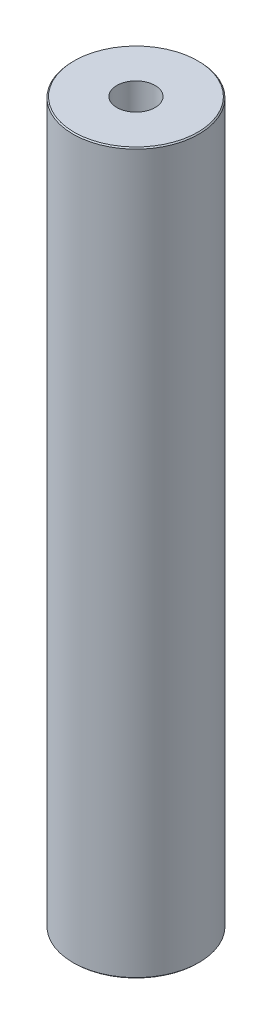
ISO-10303-21;
HEADER;
FILE_DESCRIPTION(('STEP AP214'),'2;1');
FILE_NAME('part.step','',(''),(''),'','','');
FILE_SCHEMA(('AUTOMOTIVE_DESIGN { 1 0 10303 214 1 1 1 1 }'));
ENDSEC;
DATA;
#1=APPLICATION_CONTEXT('core data for automotive mechanical design processes');
#2=APPLICATION_PROTOCOL_DEFINITION('international standard','automotive_design',2000,#1);
#3=PRODUCT_CONTEXT('',#1,'mechanical');
#4=PRODUCT('Part','Part','',(#3));
#5=PRODUCT_RELATED_PRODUCT_CATEGORY('part','',(#4));
#6=PRODUCT_DEFINITION_FORMATION('','',#4);
#7=PRODUCT_DEFINITION_CONTEXT('part definition',#1,'design');
#8=PRODUCT_DEFINITION('design','',#6,#7);
#9=PRODUCT_DEFINITION_SHAPE('','',#8);
#10=(LENGTH_UNIT() NAMED_UNIT(*) SI_UNIT(.MILLI.,.METRE.));
#11=(NAMED_UNIT(*) PLANE_ANGLE_UNIT() SI_UNIT($,.RADIAN.));
#12=(NAMED_UNIT(*) SI_UNIT($,.STERADIAN.) SOLID_ANGLE_UNIT());
#13=UNCERTAINTY_MEASURE_WITH_UNIT(LENGTH_MEASURE(1.E-05),#10,'distance_accuracy_value','');
#14=(GEOMETRIC_REPRESENTATION_CONTEXT(3) GLOBAL_UNCERTAINTY_ASSIGNED_CONTEXT((#13)) GLOBAL_UNIT_ASSIGNED_CONTEXT((#10,
#11,#12)) REPRESENTATION_CONTEXT('',''));
#15=CARTESIAN_POINT('',(0.,0.,0.));
#16=DIRECTION('',(0.,0.,1.));
#17=DIRECTION('',(1.,0.,0.));
#18=AXIS2_PLACEMENT_3D('',#15,#16,#17);
#19=CARTESIAN_POINT('',(0.,600.,0.));
#20=DIRECTION('',(0.,-1.,0.));
#21=DIRECTION('',(0.,0.,-1.));
#22=AXIS2_PLACEMENT_3D('',#19,#20,#21);
#23=CYLINDRICAL_SURFACE('',#22,52.5);
#24=CARTESIAN_POINT('',(0.,599.064436254408,0.));
#25=DIRECTION('',(0.,1.,0.));
#26=DIRECTION('',(0.,0.,1.));
#27=AXIS2_PLACEMENT_3D('',#24,#25,#26);
#28=CIRCLE('',#27,52.5);
#29=CARTESIAN_POINT('',(0.,599.064436254408,52.5));
#30=VERTEX_POINT('',#29);
#31=EDGE_CURVE('E50',#30,#30,#28,.F.);
#32=ORIENTED_EDGE('',*,*,#31,.T.);
#33=EDGE_LOOP('',(#32));
#34=FACE_BOUND('',#33,.T.);
#35=CARTESIAN_POINT('',(0.,0.935563745591339,0.));
#36=DIRECTION('',(0.,1.,0.));
#37=DIRECTION('',(0.,0.,1.));
#38=AXIS2_PLACEMENT_3D('',#35,#36,#37);
#39=CIRCLE('',#38,52.5);
#40=CARTESIAN_POINT('',(0.,0.935563745591339,52.5));
#41=VERTEX_POINT('',#40);
#42=EDGE_CURVE('E51',#41,#41,#39,.T.);
#43=ORIENTED_EDGE('',*,*,#42,.T.);
#44=EDGE_LOOP('',(#43));
#45=FACE_BOUND('',#44,.T.);
#46=ADVANCED_FACE('F39',(#34,#45),#23,.T.);
#47=CARTESIAN_POINT('',(0.,600.,0.));
#48=DIRECTION('',(0.,1.,0.));
#49=DIRECTION('',(0.,0.,1.));
#50=AXIS2_PLACEMENT_3D('',#47,#48,#49);
#51=PLANE('',#50);
#52=CARTESIAN_POINT('',(0.,600.,0.));
#53=DIRECTION('',(0.,1.,0.));
#54=DIRECTION('',(0.,0.,1.));
#55=AXIS2_PLACEMENT_3D('',#52,#53,#54);
#56=CIRCLE('',#55,51.5644362544085);
#57=CARTESIAN_POINT('',(0.,600.,51.5644362544085));
#58=VERTEX_POINT('',#57);
#59=EDGE_CURVE('E54',#58,#58,#56,.T.);
#60=ORIENTED_EDGE('',*,*,#59,.T.);
#61=EDGE_LOOP('',(#60));
#62=FACE_BOUND('',#61,.T.);
#63=CARTESIAN_POINT('',(0.,600.,0.));
#64=DIRECTION('',(0.,1.,0.));
#65=DIRECTION('',(0.,0.,1.));
#66=AXIS2_PLACEMENT_3D('',#63,#64,#65);
#67=CIRCLE('',#66,15.9771320521125);
#68=CARTESIAN_POINT('',(0.,600.,15.9771320521125));
#69=VERTEX_POINT('',#68);
#70=EDGE_CURVE('E58',#69,#69,#67,.T.);
#71=ORIENTED_EDGE('',*,*,#70,.F.);
#72=EDGE_LOOP('',(#71));
#73=FACE_BOUND('',#72,.T.);
#74=ADVANCED_FACE('F69',(#62,#73),#51,.T.);
#75=CARTESIAN_POINT('',(0.,0.,0.));
#76=DIRECTION('',(0.,1.,0.));
#77=DIRECTION('',(0.,0.,1.));
#78=AXIS2_PLACEMENT_3D('',#75,#76,#77);
#79=PLANE('',#78);
#80=CARTESIAN_POINT('',(0.,0.,0.));
#81=DIRECTION('',(0.,1.,0.));
#82=DIRECTION('',(0.,0.,1.));
#83=AXIS2_PLACEMENT_3D('',#80,#81,#82);
#84=CIRCLE('',#83,51.5644362544087);
#85=CARTESIAN_POINT('',(0.,0.,51.5644362544087));
#86=VERTEX_POINT('',#85);
#87=EDGE_CURVE('E10',#86,#86,#84,.F.);
#88=ORIENTED_EDGE('',*,*,#87,.T.);
#89=EDGE_LOOP('',(#88));
#90=FACE_BOUND('',#89,.T.);
#91=CARTESIAN_POINT('',(0.,0.,0.));
#92=DIRECTION('',(0.,1.,0.));
#93=DIRECTION('',(0.,0.,1.));
#94=AXIS2_PLACEMENT_3D('',#91,#92,#93);
#95=CIRCLE('',#94,15.9771320521125);
#96=CARTESIAN_POINT('',(0.,0.,15.9771320521125));
#97=VERTEX_POINT('',#96);
#98=EDGE_CURVE('E63',#97,#97,#95,.T.);
#99=ORIENTED_EDGE('',*,*,#98,.T.);
#100=EDGE_LOOP('',(#99));
#101=FACE_BOUND('',#100,.T.);
#102=ADVANCED_FACE('F75',(#90,#101),#79,.F.);
#103=CARTESIAN_POINT('',(0.,600.,0.));
#104=DIRECTION('',(0.,-1.,0.));
#105=DIRECTION('',(0.,0.,-1.));
#106=AXIS2_PLACEMENT_3D('',#103,#104,#105);
#107=CYLINDRICAL_SURFACE('',#106,15.9771320521125);
#108=ORIENTED_EDGE('',*,*,#70,.T.);
#109=EDGE_LOOP('',(#108));
#110=FACE_BOUND('',#109,.T.);
#111=ORIENTED_EDGE('',*,*,#98,.F.);
#112=EDGE_LOOP('',(#111));
#113=FACE_BOUND('',#112,.T.);
#114=ADVANCED_FACE('F70',(#110,#113),#107,.F.);
#115=CARTESIAN_POINT('',(0.,600.,0.));
#116=DIRECTION('',(0.,-1.,0.));
#117=DIRECTION('',(0.,0.,-1.));
#118=AXIS2_PLACEMENT_3D('',#115,#116,#117);
#119=CONICAL_SURFACE('',#118,51.5644362544085,0.785398163397419);
#120=ORIENTED_EDGE('',*,*,#31,.F.);
#121=EDGE_LOOP('',(#120));
#122=FACE_BOUND('',#121,.T.);
#123=ORIENTED_EDGE('',*,*,#59,.F.);
#124=EDGE_LOOP('',(#123));
#125=FACE_BOUND('',#124,.T.);
#126=ADVANCED_FACE('F81',(#122,#125),#119,.T.);
#127=CARTESIAN_POINT('',(0.,0.935563745591339,0.));
#128=DIRECTION('',(0.,1.,0.));
#129=DIRECTION('',(0.,0.,1.));
#130=AXIS2_PLACEMENT_3D('',#127,#128,#129);
#131=CONICAL_SURFACE('',#130,52.5,0.785398163397452);
#132=ORIENTED_EDGE('',*,*,#87,.F.);
#133=EDGE_LOOP('',(#132));
#134=FACE_BOUND('',#133,.T.);
#135=ORIENTED_EDGE('',*,*,#42,.F.);
#136=EDGE_LOOP('',(#135));
#137=FACE_BOUND('',#136,.T.);
#138=ADVANCED_FACE('F45',(#134,#137),#131,.T.);
#139=CLOSED_SHELL('',(#46,#74,#102,#114,#126,#138));
#140=MANIFOLD_SOLID_BREP('B2',#139);
#141=ADVANCED_BREP_SHAPE_REPRESENTATION('',(#18,#140),#14);
#142=SHAPE_DEFINITION_REPRESENTATION(#9,#141);
ENDSEC;
END-ISO-10303-21;
